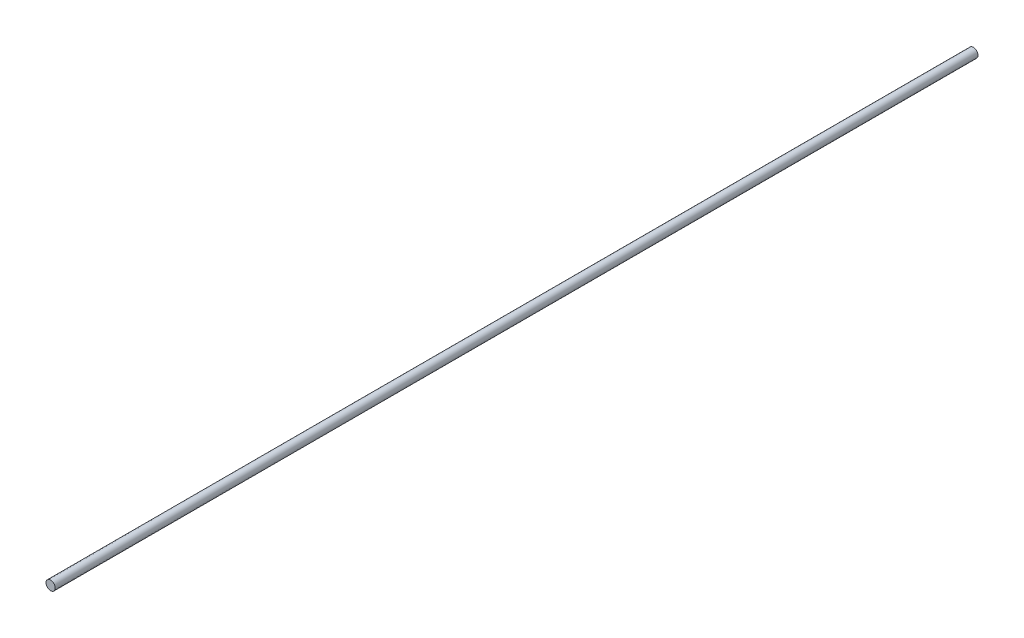
ISO-10303-21;
HEADER;
FILE_DESCRIPTION(('STEP AP214'),'2;1');
FILE_NAME('part.step','',(''),(''),'','','');
FILE_SCHEMA(('AUTOMOTIVE_DESIGN { 1 0 10303 214 1 1 1 1 }'));
ENDSEC;
DATA;
#1=APPLICATION_CONTEXT('core data for automotive mechanical design processes');
#2=APPLICATION_PROTOCOL_DEFINITION('international standard','automotive_design',2000,#1);
#3=PRODUCT_CONTEXT('',#1,'mechanical');
#4=PRODUCT('Part','Part','',(#3));
#5=PRODUCT_RELATED_PRODUCT_CATEGORY('part','',(#4));
#6=PRODUCT_DEFINITION_FORMATION('','',#4);
#7=PRODUCT_DEFINITION_CONTEXT('part definition',#1,'design');
#8=PRODUCT_DEFINITION('design','',#6,#7);
#9=PRODUCT_DEFINITION_SHAPE('','',#8);
#10=(LENGTH_UNIT() NAMED_UNIT(*) SI_UNIT(.MILLI.,.METRE.));
#11=(NAMED_UNIT(*) PLANE_ANGLE_UNIT() SI_UNIT($,.RADIAN.));
#12=(NAMED_UNIT(*) SI_UNIT($,.STERADIAN.) SOLID_ANGLE_UNIT());
#13=UNCERTAINTY_MEASURE_WITH_UNIT(LENGTH_MEASURE(1.E-05),#10,'distance_accuracy_value','');
#14=(GEOMETRIC_REPRESENTATION_CONTEXT(3) GLOBAL_UNCERTAINTY_ASSIGNED_CONTEXT((#13)) GLOBAL_UNIT_ASSIGNED_CONTEXT((#10,
#11,#12)) REPRESENTATION_CONTEXT('',''));
#15=CARTESIAN_POINT('',(0.,0.,0.));
#16=DIRECTION('',(0.,0.,1.));
#17=DIRECTION('',(1.,0.,0.));
#18=AXIS2_PLACEMENT_3D('',#15,#16,#17);
#19=CARTESIAN_POINT('',(0.,0.,400.));
#20=DIRECTION('',(0.,0.,-1.));
#21=DIRECTION('',(-1.,0.,0.));
#22=AXIS2_PLACEMENT_3D('',#19,#20,#21);
#23=CYLINDRICAL_SURFACE('',#22,4.);
#24=CARTESIAN_POINT('',(0.,0.,400.));
#25=DIRECTION('',(0.,0.,1.));
#26=DIRECTION('',(1.,0.,0.));
#27=AXIS2_PLACEMENT_3D('',#24,#25,#26);
#28=CIRCLE('',#27,4.);
#29=CARTESIAN_POINT('',(4.,0.,400.));
#30=VERTEX_POINT('',#29);
#31=EDGE_CURVE('E10',#30,#30,#28,.T.);
#32=ORIENTED_EDGE('',*,*,#31,.F.);
#33=EDGE_LOOP('',(#32));
#34=FACE_BOUND('',#33,.T.);
#35=CARTESIAN_POINT('',(0.,0.,-400.));
#36=DIRECTION('',(0.,0.,1.));
#37=DIRECTION('',(1.,0.,0.));
#38=AXIS2_PLACEMENT_3D('',#35,#36,#37);
#39=CIRCLE('',#38,4.);
#40=CARTESIAN_POINT('',(4.,0.,-400.));
#41=VERTEX_POINT('',#40);
#42=EDGE_CURVE('E39',#41,#41,#39,.T.);
#43=ORIENTED_EDGE('',*,*,#42,.T.);
#44=EDGE_LOOP('',(#43));
#45=FACE_BOUND('',#44,.T.);
#46=ADVANCED_FACE('F36',(#34,#45),#23,.T.);
#47=CARTESIAN_POINT('',(0.,0.,400.));
#48=DIRECTION('',(0.,0.,1.));
#49=DIRECTION('',(1.,0.,0.));
#50=AXIS2_PLACEMENT_3D('',#47,#48,#49);
#51=PLANE('',#50);
#52=ORIENTED_EDGE('',*,*,#31,.T.);
#53=EDGE_LOOP('',(#52));
#54=FACE_BOUND('',#53,.T.);
#55=ADVANCED_FACE('F51',(#54),#51,.T.);
#56=CARTESIAN_POINT('',(0.,0.,-400.));
#57=DIRECTION('',(0.,0.,1.));
#58=DIRECTION('',(1.,0.,0.));
#59=AXIS2_PLACEMENT_3D('',#56,#57,#58);
#60=PLANE('',#59);
#61=ORIENTED_EDGE('',*,*,#42,.F.);
#62=EDGE_LOOP('',(#61));
#63=FACE_BOUND('',#62,.T.);
#64=ADVANCED_FACE('F49',(#63),#60,.F.);
#65=CLOSED_SHELL('',(#46,#55,#64));
#66=MANIFOLD_SOLID_BREP('B2',#65);
#67=ADVANCED_BREP_SHAPE_REPRESENTATION('',(#18,#66),#14);
#68=SHAPE_DEFINITION_REPRESENTATION(#9,#67);
ENDSEC;
END-ISO-10303-21;
